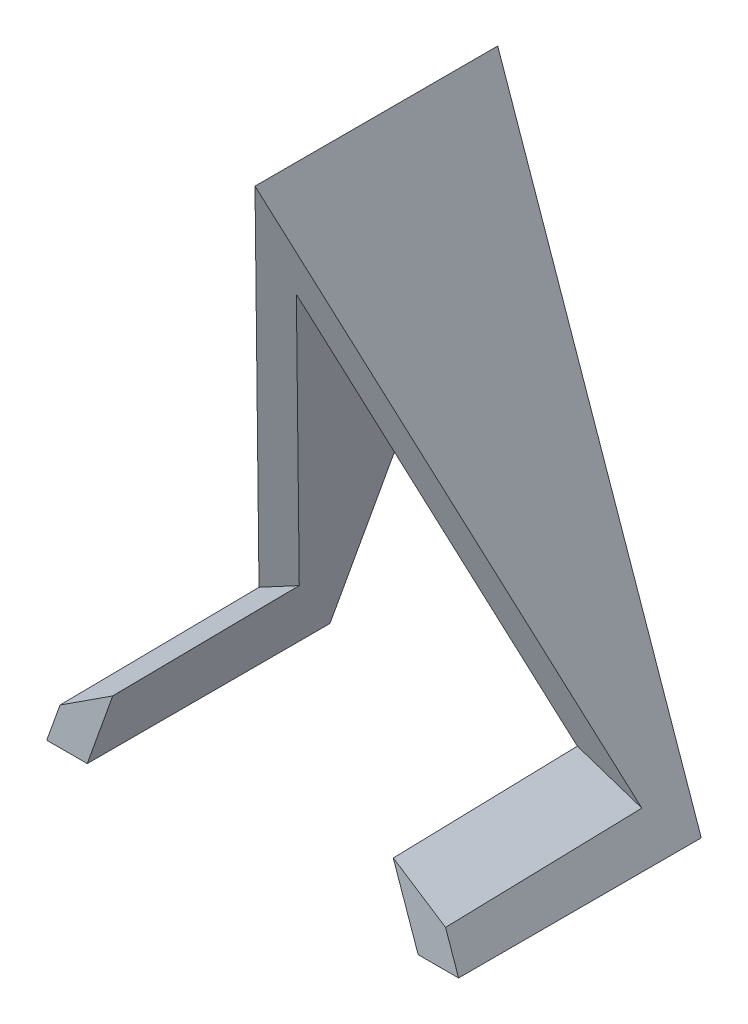
ISO-10303-21;
HEADER;
FILE_DESCRIPTION(('STEP AP214'),'2;1');
FILE_NAME('part.step','',(''),(''),'','','');
FILE_SCHEMA(('AUTOMOTIVE_DESIGN { 1 0 10303 214 1 1 1 1 }'));
ENDSEC;
DATA;
#1=APPLICATION_CONTEXT('core data for automotive mechanical design processes');
#2=APPLICATION_PROTOCOL_DEFINITION('international standard','automotive_design',2000,#1);
#3=PRODUCT_CONTEXT('',#1,'mechanical');
#4=PRODUCT('Part','Part','',(#3));
#5=PRODUCT_RELATED_PRODUCT_CATEGORY('part','',(#4));
#6=PRODUCT_DEFINITION_FORMATION('','',#4);
#7=PRODUCT_DEFINITION_CONTEXT('part definition',#1,'design');
#8=PRODUCT_DEFINITION('design','',#6,#7);
#9=PRODUCT_DEFINITION_SHAPE('','',#8);
#10=(LENGTH_UNIT() NAMED_UNIT(*) SI_UNIT(.MILLI.,.METRE.));
#11=(NAMED_UNIT(*) PLANE_ANGLE_UNIT() SI_UNIT($,.RADIAN.));
#12=(NAMED_UNIT(*) SI_UNIT($,.STERADIAN.) SOLID_ANGLE_UNIT());
#13=UNCERTAINTY_MEASURE_WITH_UNIT(LENGTH_MEASURE(1.E-05),#10,'distance_accuracy_value','');
#14=(GEOMETRIC_REPRESENTATION_CONTEXT(3) GLOBAL_UNCERTAINTY_ASSIGNED_CONTEXT((#13)) GLOBAL_UNIT_ASSIGNED_CONTEXT((#10,
#11,#12)) REPRESENTATION_CONTEXT('',''));
#15=CARTESIAN_POINT('',(0.,0.,0.));
#16=DIRECTION('',(0.,0.,1.));
#17=DIRECTION('',(1.,0.,0.));
#18=AXIS2_PLACEMENT_3D('',#15,#16,#17);
#19=CARTESIAN_POINT('',(0.,0.,30.));
#20=DIRECTION('',(0.,0.,-1.));
#21=DIRECTION('',(-1.,0.,0.));
#22=AXIS2_PLACEMENT_3D('',#19,#20,#21);
#23=PLANE('',#22);
#24=DIRECTION('',(-0.329143529811801,0.944279903833089,0.));
#25=VECTOR('',#24,1.);
#26=CARTESIAN_POINT('',(25.216807168713,-25.5895785355567,30.));
#27=LINE('',#26,#25);
#28=CARTESIAN_POINT('',(25.216807168713,-25.5895785355567,30.));
#29=VERTEX_POINT('',#28);
#30=CARTESIAN_POINT('',(23.6082543805266,-20.9748012892667,30.));
#31=VERTEX_POINT('',#30);
#32=EDGE_CURVE('E151',#29,#31,#27,.T.);
#33=ORIENTED_EDGE('',*,*,#32,.T.);
#34=DIRECTION('',(0.838650945886874,-0.544669249143966,0.));
#35=VECTOR('',#34,1.);
#36=CARTESIAN_POINT('',(23.6095998045557,-20.9756750867617,30.));
#37=LINE('',#36,#35);
#38=CARTESIAN_POINT('',(17.1451410727276,-16.777275382027,30.));
#39=VERTEX_POINT('',#38);
#40=EDGE_CURVE('E186',#31,#39,#37,.F.);
#41=ORIENTED_EDGE('',*,*,#40,.T.);
#42=DIRECTION('',(0.3291435298118,-0.944279903833089,0.));
#43=VECTOR('',#42,1.);
#44=CARTESIAN_POINT('',(0.,32.4104214644433,30.));
#45=LINE('',#44,#43);
#46=CARTESIAN_POINT('',(20.216807168713,-25.5895785355567,30.));
#47=VERTEX_POINT('',#46);
#48=EDGE_CURVE('E142',#39,#47,#45,.T.);
#49=ORIENTED_EDGE('',*,*,#48,.T.);
#50=DIRECTION('',(1.,0.,0.));
#51=VECTOR('',#50,1.);
#52=CARTESIAN_POINT('',(20.216807168713,-25.5895785355567,30.));
#53=LINE('',#52,#51);
#54=EDGE_CURVE('E144',#47,#29,#53,.T.);
#55=ORIENTED_EDGE('',*,*,#54,.T.);
#56=EDGE_LOOP('',(#33,#41,#49,#55));
#57=FACE_BOUND('',#56,.T.);
#58=ADVANCED_FACE('F37',(#57),#23,.F.);
#59=CARTESIAN_POINT('',(-25.6924714905346,-25.5895785355567,30.));
#60=DIRECTION('',(0.,1.,0.));
#61=DIRECTION('',(0.,0.,1.));
#62=AXIS2_PLACEMENT_3D('',#59,#60,#61);
#63=PLANE('',#62);
#64=DIRECTION('',(1.,0.,0.));
#65=VECTOR('',#64,1.);
#66=CARTESIAN_POINT('',(-25.6924714905346,-25.5895785355567,0.));
#67=LINE('',#66,#65);
#68=CARTESIAN_POINT('',(-25.6924714905346,-25.5895785355567,0.));
#69=VERTEX_POINT('',#68);
#70=CARTESIAN_POINT('',(-20.683192831287,-25.5895785355567,0.));
#71=VERTEX_POINT('',#70);
#72=EDGE_CURVE('E157',#69,#71,#67,.T.);
#73=ORIENTED_EDGE('',*,*,#72,.T.);
#74=DIRECTION('',(0.,0.,-1.));
#75=VECTOR('',#74,1.);
#76=CARTESIAN_POINT('',(-20.683192831287,-25.5895785355567,30.));
#77=LINE('',#76,#75);
#78=CARTESIAN_POINT('',(-20.683192831287,-25.5895785355567,30.));
#79=VERTEX_POINT('',#78);
#80=EDGE_CURVE('E126',#79,#71,#77,.T.);
#81=ORIENTED_EDGE('',*,*,#80,.F.);
#82=DIRECTION('',(1.,0.,0.));
#83=VECTOR('',#82,1.);
#84=CARTESIAN_POINT('',(-25.6924714905346,-25.5895785355567,30.));
#85=LINE('',#84,#83);
#86=CARTESIAN_POINT('',(-25.6924714905346,-25.5895785355567,30.));
#87=VERTEX_POINT('',#86);
#88=EDGE_CURVE('E140',#87,#79,#85,.T.);
#89=ORIENTED_EDGE('',*,*,#88,.F.);
#90=DIRECTION('',(0.,0.,-1.));
#91=VECTOR('',#90,1.);
#92=CARTESIAN_POINT('',(-25.6924714905346,-25.5895785355567,30.));
#93=LINE('',#92,#91);
#94=EDGE_CURVE('E156',#87,#69,#93,.T.);
#95=ORIENTED_EDGE('',*,*,#94,.T.);
#96=EDGE_LOOP('',(#73,#81,#89,#95));
#97=FACE_BOUND('',#96,.T.);
#98=ADVANCED_FACE('F230',(#97),#63,.F.);
#99=CARTESIAN_POINT('',(-20.683192831287,-25.5895785355567,30.));
#100=DIRECTION('',(-0.941901740434057,0.335888540095214,0.));
#101=DIRECTION('',(-0.335888540095214,-0.941901740434057,0.));
#102=AXIS2_PLACEMENT_3D('',#99,#100,#101);
#103=PLANE('',#102);
#104=DIRECTION('',(0.,0.,-1.));
#105=VECTOR('',#104,1.);
#106=CARTESIAN_POINT('',(0.,32.4104214644433,30.));
#107=LINE('',#106,#105);
#108=CARTESIAN_POINT('',(0.,32.4104214644433,24.8337747943854));
#109=VERTEX_POINT('',#108);
#110=CARTESIAN_POINT('',(0.,32.4104214644433,0.));
#111=VERTEX_POINT('',#110);
#112=EDGE_CURVE('E181',#109,#111,#107,.T.);
#113=ORIENTED_EDGE('',*,*,#112,.F.);
#114=DIRECTION('',(-0.317735614177042,-0.890997138236405,-0.324296437134414));
#115=VECTOR('',#114,1.);
#116=CARTESIAN_POINT('',(-17.9756485314256,-17.9970578511092,6.4869527391354));
#117=LINE('',#116,#115);
#118=CARTESIAN_POINT('',(-17.3833857943414,-16.3362292241613,7.09144492356162));
#119=VERTEX_POINT('',#118);
#120=EDGE_CURVE('E134',#109,#119,#117,.T.);
#121=ORIENTED_EDGE('',*,*,#120,.T.);
#122=DIRECTION('',(-0.00686265654519206,-0.0192443247455994,0.999791258168538));
#123=VECTOR('',#122,1.);
#124=CARTESIAN_POINT('',(-17.5419439944799,-16.7808595906164,30.1911150535654));
#125=LINE('',#124,#123);
#126=CARTESIAN_POINT('',(-17.5406321636727,-16.777180942574,30.));
#127=VERTEX_POINT('',#126);
#128=EDGE_CURVE('E120',#119,#127,#125,.T.);
#129=ORIENTED_EDGE('',*,*,#128,.T.);
#130=DIRECTION('',(0.335888540095214,0.941901740434057,0.));
#131=VECTOR('',#130,1.);
#132=CARTESIAN_POINT('',(-20.683192831287,-25.5895785355567,30.));
#133=LINE('',#132,#131);
#134=EDGE_CURVE('E132',#79,#127,#133,.T.);
#135=ORIENTED_EDGE('',*,*,#134,.F.);
#136=ORIENTED_EDGE('',*,*,#80,.T.);
#137=DIRECTION('',(0.335888540095214,0.941901740434057,0.));
#138=VECTOR('',#137,1.);
#139=CARTESIAN_POINT('',(-20.683192831287,-25.5895785355567,0.));
#140=LINE('',#139,#138);
#141=EDGE_CURVE('E160',#71,#111,#140,.T.);
#142=ORIENTED_EDGE('',*,*,#141,.T.);
#143=EDGE_LOOP('',(#113,#121,#129,#135,#136,#142));
#144=FACE_BOUND('',#143,.T.);
#145=ADVANCED_FACE('F130',(#144),#103,.F.);
#146=CARTESIAN_POINT('',(0.,32.4104214644433,30.));
#147=DIRECTION('',(0.944279903833089,0.3291435298118,0.));
#148=DIRECTION('',(-0.3291435298118,0.944279903833089,0.));
#149=AXIS2_PLACEMENT_3D('',#146,#147,#148);
#150=PLANE('',#149);
#151=DIRECTION('',(0.00670791743077441,-0.0192443449521057,0.999792307947559));
#152=VECTOR('',#151,1.);
#153=CARTESIAN_POINT('',(17.1466418422813,-16.7815809399417,30.2236846042443));
#154=LINE('',#153,#152);
#155=CARTESIAN_POINT('',(16.9914402254039,-16.3363230065911,7.0914107895487));
#156=VERTEX_POINT('',#155);
#157=EDGE_CURVE('E188',#39,#156,#154,.F.);
#158=ORIENTED_EDGE('',*,*,#157,.T.);
#159=DIRECTION('',(-0.311272387749598,0.893009382679194,0.325028834215657));
#160=VECTOR('',#159,1.);
#161=CARTESIAN_POINT('',(-0.522679926402301,33.9099379547746,25.3795541626574));
#162=LINE('',#161,#160);
#163=EDGE_CURVE('E203',#156,#109,#162,.T.);
#164=ORIENTED_EDGE('',*,*,#163,.T.);
#165=ORIENTED_EDGE('',*,*,#112,.T.);
#166=DIRECTION('',(0.3291435298118,-0.944279903833089,0.));
#167=VECTOR('',#166,1.);
#168=CARTESIAN_POINT('',(0.,32.4104214644433,0.));
#169=LINE('',#168,#167);
#170=CARTESIAN_POINT('',(20.216807168713,-25.5895785355567,0.));
#171=VERTEX_POINT('',#170);
#172=EDGE_CURVE('E163',#111,#171,#169,.T.);
#173=ORIENTED_EDGE('',*,*,#172,.T.);
#174=DIRECTION('',(0.,0.,-1.));
#175=VECTOR('',#174,1.);
#176=CARTESIAN_POINT('',(20.216807168713,-25.5895785355567,30.));
#177=LINE('',#176,#175);
#178=EDGE_CURVE('E178',#47,#171,#177,.T.);
#179=ORIENTED_EDGE('',*,*,#178,.F.);
#180=ORIENTED_EDGE('',*,*,#48,.F.);
#181=EDGE_LOOP('',(#158,#164,#165,#173,#179,#180));
#182=FACE_BOUND('',#181,.T.);
#183=ADVANCED_FACE('F232',(#182),#150,.F.);
#184=CARTESIAN_POINT('',(20.216807168713,-25.5895785355567,30.));
#185=DIRECTION('',(0.,1.,0.));
#186=DIRECTION('',(0.,0.,1.));
#187=AXIS2_PLACEMENT_3D('',#184,#185,#186);
#188=PLANE('',#187);
#189=DIRECTION('',(1.,0.,0.));
#190=VECTOR('',#189,1.);
#191=CARTESIAN_POINT('',(20.216807168713,-25.5895785355567,0.));
#192=LINE('',#191,#190);
#193=CARTESIAN_POINT('',(25.216807168713,-25.5895785355567,0.));
#194=VERTEX_POINT('',#193);
#195=EDGE_CURVE('E165',#171,#194,#192,.T.);
#196=ORIENTED_EDGE('',*,*,#195,.T.);
#197=DIRECTION('',(0.,0.,-1.));
#198=VECTOR('',#197,1.);
#199=CARTESIAN_POINT('',(25.216807168713,-25.5895785355567,30.));
#200=LINE('',#199,#198);
#201=EDGE_CURVE('E175',#29,#194,#200,.T.);
#202=ORIENTED_EDGE('',*,*,#201,.F.);
#203=ORIENTED_EDGE('',*,*,#54,.F.);
#204=ORIENTED_EDGE('',*,*,#178,.T.);
#205=EDGE_LOOP('',(#196,#202,#203,#204));
#206=FACE_BOUND('',#205,.T.);
#207=ADVANCED_FACE('F217',(#206),#188,.F.);
#208=CARTESIAN_POINT('',(25.216807168713,-25.5895785355567,30.));
#209=DIRECTION('',(-0.944279903833089,-0.329143529811801,0.));
#210=DIRECTION('',(0.329143529811801,-0.944279903833089,0.));
#211=AXIS2_PLACEMENT_3D('',#208,#209,#210);
#212=PLANE('',#211);
#213=DIRECTION('',(0.311272387749598,-0.893009382679194,-0.325028834215657));
#214=VECTOR('',#213,1.);
#215=CARTESIAN_POINT('',(22.5583480600513,-17.9627249470732,6.4994488942604));
#216=LINE('',#215,#214);
#217=CARTESIAN_POINT('',(0.0524289351607962,46.6045085606869,30.));
#218=VERTEX_POINT('',#217);
#219=CARTESIAN_POINT('',(23.4443745314698,-20.5046463747949,5.57426515672629));
#220=VERTEX_POINT('',#219);
#221=EDGE_CURVE('E200',#218,#220,#216,.T.);
#222=ORIENTED_EDGE('',*,*,#221,.T.);
#223=DIRECTION('',(0.00670791743077442,-0.0192443449521057,0.999792307947559));
#224=VECTOR('',#223,1.);
#225=CARTESIAN_POINT('',(23.6089224784002,-20.9767179953194,30.0995777186939));
#226=LINE('',#225,#224);
#227=EDGE_CURVE('E125',#220,#31,#226,.T.);
#228=ORIENTED_EDGE('',*,*,#227,.T.);
#229=ORIENTED_EDGE('',*,*,#32,.F.);
#230=ORIENTED_EDGE('',*,*,#201,.T.);
#231=DIRECTION('',(-0.329143529811801,0.944279903833089,0.));
#232=VECTOR('',#231,1.);
#233=CARTESIAN_POINT('',(25.216807168713,-25.5895785355567,0.));
#234=LINE('',#233,#232);
#235=CARTESIAN_POINT('',(0.0524289351607893,46.6045085606869,0.));
#236=VERTEX_POINT('',#235);
#237=EDGE_CURVE('E167',#194,#236,#234,.T.);
#238=ORIENTED_EDGE('',*,*,#237,.T.);
#239=DIRECTION('',(0.,0.,-1.));
#240=VECTOR('',#239,1.);
#241=CARTESIAN_POINT('',(0.0524289351607893,46.6045085606869,30.));
#242=LINE('',#241,#240);
#243=EDGE_CURVE('E172',#218,#236,#242,.T.);
#244=ORIENTED_EDGE('',*,*,#243,.F.);
#245=EDGE_LOOP('',(#222,#228,#229,#230,#238,#244));
#246=FACE_BOUND('',#245,.T.);
#247=ADVANCED_FACE('F209',(#246),#212,.F.);
#248=CARTESIAN_POINT('',(0.0524289351607893,46.6045085606869,30.));
#249=DIRECTION('',(0.941901740434057,-0.335888540095214,0.));
#250=DIRECTION('',(0.335888540095214,0.941901740434057,0.));
#251=AXIS2_PLACEMENT_3D('',#248,#249,#250);
#252=PLANE('',#251);
#253=DIRECTION('',(-0.335888540095214,-0.941901740434057,0.));
#254=VECTOR('',#253,1.);
#255=CARTESIAN_POINT('',(0.0524289351607893,46.6045085606869,30.));
#256=LINE('',#255,#254);
#257=CARTESIAN_POINT('',(-24.0569800065213,-21.0033182397439,30.));
#258=VERTEX_POINT('',#257);
#259=EDGE_CURVE('E154',#258,#87,#256,.T.);
#260=ORIENTED_EDGE('',*,*,#259,.F.);
#261=DIRECTION('',(0.00686265654519206,0.0192443247455994,-0.999791258168538));
#262=VECTOR('',#261,1.);
#263=CARTESIAN_POINT('',(-24.0469157726884,-20.9750960224551,28.5337845570318));
#264=LINE('',#263,#262);
#265=CARTESIAN_POINT('',(-23.8892488307501,-20.532964930461,5.56395804538642));
#266=VERTEX_POINT('',#265);
#267=EDGE_CURVE('E191',#258,#266,#264,.T.);
#268=ORIENTED_EDGE('',*,*,#267,.T.);
#269=DIRECTION('',(0.317735614177042,0.890997138236405,0.324296437134414));
#270=VECTOR('',#269,1.);
#271=CARTESIAN_POINT('',(0.0524289351607893,46.6045085606869,30.));
#272=LINE('',#271,#270);
#273=EDGE_CURVE('E135',#266,#218,#272,.T.);
#274=ORIENTED_EDGE('',*,*,#273,.T.);
#275=ORIENTED_EDGE('',*,*,#243,.T.);
#276=DIRECTION('',(-0.335888540095214,-0.941901740434057,0.));
#277=VECTOR('',#276,1.);
#278=CARTESIAN_POINT('',(0.0524289351607893,46.6045085606869,0.));
#279=LINE('',#278,#277);
#280=EDGE_CURVE('E146',#236,#69,#279,.T.);
#281=ORIENTED_EDGE('',*,*,#280,.T.);
#282=ORIENTED_EDGE('',*,*,#94,.F.);
#283=EDGE_LOOP('',(#260,#268,#274,#275,#281,#282));
#284=FACE_BOUND('',#283,.T.);
#285=ADVANCED_FACE('F228',(#284),#252,.F.);
#286=DIRECTION('',(-1.,0.,0.));
#287=VECTOR('',#286,1.);
#288=CARTESIAN_POINT('',(0.,-16.777180942574,30.));
#289=LINE('',#288,#287);
#290=CARTESIAN_POINT('',(-17.5497930786241,-16.777180942574,30.));
#291=VERTEX_POINT('',#290);
#292=EDGE_CURVE('E117',#127,#291,#289,.T.);
#293=ORIENTED_EDGE('',*,*,#292,.T.);
#294=DIRECTION('',(0.838651688317813,0.544668105989035,0.));
#295=VECTOR('',#294,1.);
#296=CARTESIAN_POINT('',(-24.0370099248923,-20.9903485329051,30.));
#297=LINE('',#296,#295);
#298=EDGE_CURVE('E195',#291,#258,#297,.F.);
#299=ORIENTED_EDGE('',*,*,#298,.T.);
#300=ORIENTED_EDGE('',*,*,#259,.T.);
#301=ORIENTED_EDGE('',*,*,#88,.T.);
#302=ORIENTED_EDGE('',*,*,#134,.T.);
#303=EDGE_LOOP('',(#293,#299,#300,#301,#302));
#304=FACE_BOUND('',#303,.T.);
#305=ADVANCED_FACE('F138',(#304),#23,.F.);
#306=CARTESIAN_POINT('',(0.,0.,0.));
#307=DIRECTION('',(0.,0.,-1.));
#308=DIRECTION('',(-1.,0.,0.));
#309=AXIS2_PLACEMENT_3D('',#306,#307,#308);
#310=PLANE('',#309);
#311=ORIENTED_EDGE('',*,*,#72,.F.);
#312=ORIENTED_EDGE('',*,*,#280,.F.);
#313=ORIENTED_EDGE('',*,*,#237,.F.);
#314=ORIENTED_EDGE('',*,*,#195,.F.);
#315=ORIENTED_EDGE('',*,*,#172,.F.);
#316=ORIENTED_EDGE('',*,*,#141,.F.);
#317=EDGE_LOOP('',(#311,#312,#313,#314,#315,#316));
#318=FACE_BOUND('',#317,.T.);
#319=ADVANCED_FACE('F223',(#318),#310,.T.);
#320=CARTESIAN_POINT('',(-40.,46.6045085606869,30.));
#321=DIRECTION('',(0.,0.342020143325663,-0.93969262078591));
#322=DIRECTION('',(0.,0.939692620785911,0.342020143325663));
#323=AXIS2_PLACEMENT_3D('',#320,#321,#322);
#324=PLANE('',#323);
#325=ORIENTED_EDGE('',*,*,#163,.F.);
#326=DIRECTION('',(-0.824075026453993,0.532317706487797,0.193747800334408));
#327=VECTOR('',#326,1.);
#328=CARTESIAN_POINT('',(-52.9793120568754,28.861831506599,23.5421936761142));
#329=LINE('',#328,#327);
#330=EDGE_CURVE('E46',#156,#220,#329,.F.);
#331=ORIENTED_EDGE('',*,*,#330,.T.);
#332=ORIENTED_EDGE('',*,*,#221,.F.);
#333=ORIENTED_EDGE('',*,*,#273,.F.);
#334=DIRECTION('',(-0.824066193370504,-0.532329781082327,-0.193752195127407));
#335=VECTOR('',#334,1.);
#336=CARTESIAN_POINT('',(-1.47671846942785,-6.0549321259051,10.8335310369743));
#337=LINE('',#336,#335);
#338=CARTESIAN_POINT('',(-17.3925467092928,-16.3362292241613,7.09144492356162));
#339=VERTEX_POINT('',#338);
#340=EDGE_CURVE('E11',#266,#339,#337,.F.);
#341=ORIENTED_EDGE('',*,*,#340,.T.);
#342=DIRECTION('',(1.,0.,0.));
#343=VECTOR('',#342,1.);
#344=CARTESIAN_POINT('',(-40.,-16.3362292241613,7.09144492356162));
#345=LINE('',#344,#343);
#346=EDGE_CURVE('E136',#339,#119,#345,.T.);
#347=ORIENTED_EDGE('',*,*,#346,.T.);
#348=ORIENTED_EDGE('',*,*,#120,.F.);
#349=EDGE_LOOP('',(#325,#331,#332,#333,#341,#347,#348));
#350=FACE_BOUND('',#349,.T.);
#351=ADVANCED_FACE('F199',(#350),#324,.F.);
#352=CARTESIAN_POINT('',(-40.,-16.3362292241613,7.09144492356162));
#353=DIRECTION('',(0.,-0.999814802112132,-0.0192447779274937));
#354=DIRECTION('',(0.,0.0192447779274937,-0.999814802112132));
#355=AXIS2_PLACEMENT_3D('',#352,#353,#354);
#356=PLANE('',#355);
#357=ORIENTED_EDGE('',*,*,#346,.F.);
#358=DIRECTION('',(-0.00686265654519206,-0.0192443247455994,0.999791258168538));
#359=VECTOR('',#358,1.);
#360=CARTESIAN_POINT('',(-17.3936114311532,-16.339214927017,7.24655972514919));
#361=LINE('',#360,#359);
#362=EDGE_CURVE('E53',#339,#291,#361,.T.);
#363=ORIENTED_EDGE('',*,*,#362,.T.);
#364=ORIENTED_EDGE('',*,*,#292,.F.);
#365=ORIENTED_EDGE('',*,*,#128,.F.);
#366=EDGE_LOOP('',(#357,#363,#364,#365));
#367=FACE_BOUND('',#366,.T.);
#368=ADVANCED_FACE('F119',(#367),#356,.F.);
#369=CARTESIAN_POINT('',(23.6089224784002,-20.9767179953194,30.0995777186939));
#370=DIRECTION('',(-0.544626781545629,-0.838585556677605,-0.0124873117587696));
#371=DIRECTION('',(0.00670791743077442,-0.0192443449521057,0.999792307947559));
#372=AXIS2_PLACEMENT_3D('',#369,#370,#371);
#373=PLANE('',#372);
#374=ORIENTED_EDGE('',*,*,#330,.F.);
#375=ORIENTED_EDGE('',*,*,#157,.F.);
#376=ORIENTED_EDGE('',*,*,#40,.F.);
#377=ORIENTED_EDGE('',*,*,#227,.F.);
#378=EDGE_LOOP('',(#374,#375,#376,#377));
#379=FACE_BOUND('',#378,.T.);
#380=ADVANCED_FACE('F206',(#379),#373,.F.);
#381=CARTESIAN_POINT('',(-24.0469157726884,-20.9750960224551,28.5337845570318));
#382=DIRECTION('',(0.544626209689083,-0.838587178569027,-0.0124030504047295));
#383=DIRECTION('',(0.00686265654519206,0.0192443247455994,-0.999791258168538));
#384=AXIS2_PLACEMENT_3D('',#381,#382,#383);
#385=PLANE('',#384);
#386=ORIENTED_EDGE('',*,*,#298,.F.);
#387=ORIENTED_EDGE('',*,*,#362,.F.);
#388=ORIENTED_EDGE('',*,*,#340,.F.);
#389=ORIENTED_EDGE('',*,*,#267,.F.);
#390=EDGE_LOOP('',(#386,#387,#388,#389));
#391=FACE_BOUND('',#390,.T.);
#392=ADVANCED_FACE('F40',(#391),#385,.F.);
#393=CLOSED_SHELL('',(#58,#98,#145,#183,#207,#247,#285,#305,#319,#351,#368,#380,#392));
#394=MANIFOLD_SOLID_BREP('B2',#393);
#395=ADVANCED_BREP_SHAPE_REPRESENTATION('',(#18,#394),#14);
#396=SHAPE_DEFINITION_REPRESENTATION(#9,#395);
ENDSEC;
END-ISO-10303-21;
